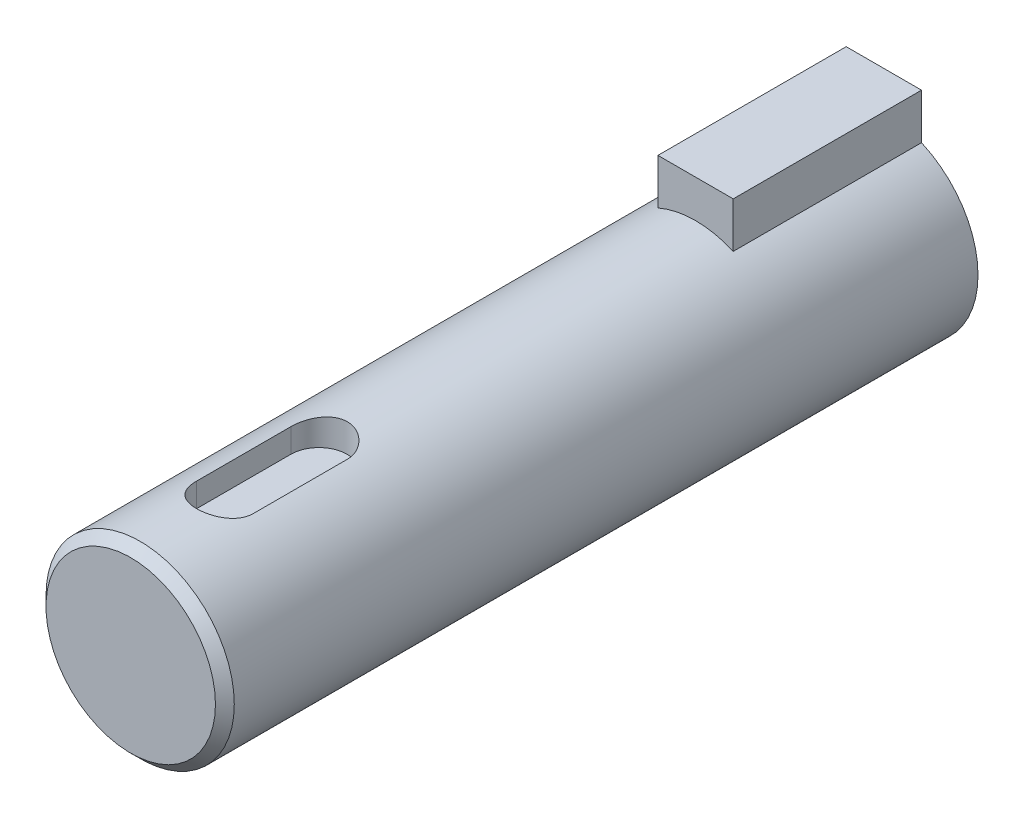
ISO-10303-21;
HEADER;
FILE_DESCRIPTION(('STEP AP214'),'2;1');
FILE_NAME('part.step','',(''),(''),'','','');
FILE_SCHEMA(('AUTOMOTIVE_DESIGN { 1 0 10303 214 1 1 1 1 }'));
ENDSEC;
DATA;
#1=APPLICATION_CONTEXT('core data for automotive mechanical design processes');
#2=APPLICATION_PROTOCOL_DEFINITION('international standard','automotive_design',2000,#1);
#3=PRODUCT_CONTEXT('',#1,'mechanical');
#4=PRODUCT('Part','Part','',(#3));
#5=PRODUCT_RELATED_PRODUCT_CATEGORY('part','',(#4));
#6=PRODUCT_DEFINITION_FORMATION('','',#4);
#7=PRODUCT_DEFINITION_CONTEXT('part definition',#1,'design');
#8=PRODUCT_DEFINITION('design','',#6,#7);
#9=PRODUCT_DEFINITION_SHAPE('','',#8);
#10=(LENGTH_UNIT() NAMED_UNIT(*) SI_UNIT(.MILLI.,.METRE.));
#11=(NAMED_UNIT(*) PLANE_ANGLE_UNIT() SI_UNIT($,.RADIAN.));
#12=(NAMED_UNIT(*) SI_UNIT($,.STERADIAN.) SOLID_ANGLE_UNIT());
#13=UNCERTAINTY_MEASURE_WITH_UNIT(LENGTH_MEASURE(1.E-05),#10,'distance_accuracy_value','');
#14=(GEOMETRIC_REPRESENTATION_CONTEXT(3) GLOBAL_UNCERTAINTY_ASSIGNED_CONTEXT((#13)) GLOBAL_UNIT_ASSIGNED_CONTEXT((#10,
#11,#12)) REPRESENTATION_CONTEXT('',''));
#15=CARTESIAN_POINT('',(0.,0.,0.));
#16=DIRECTION('',(0.,0.,1.));
#17=DIRECTION('',(1.,0.,0.));
#18=AXIS2_PLACEMENT_3D('',#15,#16,#17);
#19=CARTESIAN_POINT('',(0.,0.,10.));
#20=DIRECTION('',(0.,0.,-1.));
#21=DIRECTION('',(-1.,0.,0.));
#22=AXIS2_PLACEMENT_3D('',#19,#20,#21);
#23=CYLINDRICAL_SURFACE('',#22,5.);
#24=CARTESIAN_POINT('',(0.,0.,39.5));
#25=DIRECTION('',(0.,0.,1.));
#26=DIRECTION('',(1.,0.,0.));
#27=AXIS2_PLACEMENT_3D('',#24,#25,#26);
#28=CIRCLE('',#27,5.);
#29=CARTESIAN_POINT('',(5.,0.,39.5));
#30=VERTEX_POINT('',#29);
#31=EDGE_CURVE('E11',#30,#30,#28,.F.);
#32=ORIENTED_EDGE('',*,*,#31,.T.);
#33=EDGE_LOOP('',(#32));
#34=FACE_BOUND('',#33,.T.);
#35=CARTESIAN_POINT('',(0.,0.,0.));
#36=DIRECTION('',(0.,0.,1.));
#37=DIRECTION('',(1.,0.,0.));
#38=AXIS2_PLACEMENT_3D('',#35,#36,#37);
#39=CIRCLE('',#38,5.);
#40=CARTESIAN_POINT('',(-2.,4.58257569495584,0.));
#41=VERTEX_POINT('',#40);
#42=CARTESIAN_POINT('',(2.,4.58257569495584,0.));
#43=VERTEX_POINT('',#42);
#44=EDGE_CURVE('E173',#41,#43,#39,.T.);
#45=ORIENTED_EDGE('',*,*,#44,.T.);
#46=DIRECTION('',(0.,0.,-1.));
#47=VECTOR('',#46,1.);
#48=CARTESIAN_POINT('',(2.,4.58257569495584,10.));
#49=LINE('',#48,#47);
#50=CARTESIAN_POINT('',(2.,4.58257569495584,10.));
#51=VERTEX_POINT('',#50);
#52=EDGE_CURVE('E186',#51,#43,#49,.T.);
#53=ORIENTED_EDGE('',*,*,#52,.F.);
#54=CARTESIAN_POINT('',(0.,0.,10.));
#55=DIRECTION('',(0.,0.,1.));
#56=DIRECTION('',(1.,0.,0.));
#57=AXIS2_PLACEMENT_3D('',#54,#55,#56);
#58=CIRCLE('',#57,5.);
#59=CARTESIAN_POINT('',(-2.,4.58257569495584,10.));
#60=VERTEX_POINT('',#59);
#61=EDGE_CURVE('E128',#51,#60,#58,.T.);
#62=ORIENTED_EDGE('',*,*,#61,.T.);
#63=DIRECTION('',(0.,0.,-1.));
#64=VECTOR('',#63,1.);
#65=CARTESIAN_POINT('',(-2.,4.58257569495584,10.));
#66=LINE('',#65,#64);
#67=EDGE_CURVE('E190',#60,#41,#66,.T.);
#68=ORIENTED_EDGE('',*,*,#67,.T.);
#69=EDGE_LOOP('',(#45,#53,#62,#68));
#70=FACE_BOUND('',#69,.T.);
#71=CARTESIAN_POINT('',(1.5,4.76969600708473,30.));
#72=CARTESIAN_POINT('',(1.50000085357071,4.76969249084934,29.958820607092));
#73=CARTESIAN_POINT('',(1.49830317083428,4.77022997000129,29.9176619568739));
#74=CARTESIAN_POINT('',(1.49153785660317,4.77235095109999,29.8356588379044));
#75=CARTESIAN_POINT('',(1.48647098275841,4.77393421787376,29.7948143006051));
#76=CARTESIAN_POINT('',(1.46630203689311,4.78018490618873,29.6734094590453));
#77=CARTESIAN_POINT('',(1.44623120413662,4.78635370384275,29.5936936095836));
#78=CARTESIAN_POINT('',(1.39353102315626,4.80195952113208,29.4389644216141));
#79=CARTESIAN_POINT('',(1.36090607068203,4.81139539670393,29.3639494478019));
#80=CARTESIAN_POINT('',(1.28407841117655,4.83246571212052,29.2204033184024));
#81=CARTESIAN_POINT('',(1.23987031651226,4.84410117434933,29.1518752002716));
#82=CARTESIAN_POINT('',(1.13964850658326,4.86866835244721,29.021133944003));
#83=CARTESIAN_POINT('',(1.08333433465208,4.88162755412974,28.9591563396566));
#84=CARTESIAN_POINT('',(0.961138919873355,4.90714811559049,28.8453644161));
#85=CARTESIAN_POINT('',(0.895256063916348,4.91970940785249,28.793551813997));
#86=CARTESIAN_POINT('',(0.754109921315431,4.94333239727705,28.7005362296815));
#87=CARTESIAN_POINT('',(0.67868081933626,4.95435770971354,28.6595748197021));
#88=CARTESIAN_POINT('',(0.521621185505775,4.97334469846208,28.5910115883819));
#89=CARTESIAN_POINT('',(0.439992259012928,4.98130716463903,28.5634063222057));
#90=CARTESIAN_POINT('',(0.275324697874878,4.99307639935002,28.523120200898));
#91=CARTESIAN_POINT('',(0.192393125294254,4.99699549276993,28.5100351420303));
#92=CARTESIAN_POINT('',(0.0254235719980824,5.00063202022426,28.4978826586367));
#93=CARTESIAN_POINT('',(-0.0586141962423618,5.00035024971471,28.4988125802998));
#94=CARTESIAN_POINT('',(-0.222571599946016,4.99569602566267,28.514392908759));
#95=CARTESIAN_POINT('',(-0.302537145464641,4.99145415509187,28.5286053449787));
#96=CARTESIAN_POINT('',(-0.458890052102025,4.9795151369998,28.5696316352381));
#97=CARTESIAN_POINT('',(-0.535277225531998,4.97181780846028,28.5964461494559));
#98=CARTESIAN_POINT('',(-0.683347815892216,4.95365214926145,28.6622122216464));
#99=CARTESIAN_POINT('',(-0.754966006044142,4.94315255692525,28.7013016443569));
#100=CARTESIAN_POINT('',(-0.89076552957442,4.92049624651755,28.7903985900483));
#101=CARTESIAN_POINT('',(-0.954945191614595,4.90833915735884,28.8404085594788));
#102=CARTESIAN_POINT('',(-1.07665450541275,4.88311673571409,28.9521919880835));
#103=CARTESIAN_POINT('',(-1.13383351478034,4.87003445449554,29.0143438637608));
#104=CARTESIAN_POINT('',(-1.23706769492487,4.84484215114658,29.1474974234279));
#105=CARTESIAN_POINT('',(-1.28311962013078,4.83273241337565,29.2185016803655));
#106=CARTESIAN_POINT('',(-1.36316407240863,4.81077228795653,29.3682809284493));
#107=CARTESIAN_POINT('',(-1.39703006341134,4.80094596245948,29.4471271795934));
#108=CARTESIAN_POINT('',(-1.45085886004699,4.78495663653201,29.6097245039817));
#109=CARTESIAN_POINT('',(-1.47084293218035,4.77878803475875,29.6934678607144));
#110=CARTESIAN_POINT('',(-1.4890120359008,4.77314032325006,29.8149948890702));
#111=CARTESIAN_POINT('',(-1.49313202989009,4.77185156275267,29.8518907341796));
#112=CARTESIAN_POINT('',(-1.49862355614854,4.77012928611782,29.9258514790995));
#113=CARTESIAN_POINT('',(-1.49999912968269,4.76969451246644,29.9629160496639));
#114=CARTESIAN_POINT('',(-1.5,4.76969600708473,30.));
#115=B_SPLINE_CURVE_WITH_KNOTS('',3,(#71,#72,#73,#74,#75,#76,#77,#78,#79,#80,#81,#82,#83,#84,
#85,#86,#87,#88,#89,#90,#91,#92,#93,#94,#95,#96,#97,#98,#99,#100,#101,#102,#103,#104,#105,#106,
#107,#108,#109,#110,#111,#112,#113,#114),.UNSPECIFIED.,.F.,.F.,(4,2,2,2,2,2,2,2,2,2,2,2,2,2,2,2,
2,2,2,2,2,4),(0.,0.123459071219734,0.246890388853047,0.492911349615212,0.738846245884326,
0.984895736828095,1.23795510798803,1.49105719006936,1.74939356197455,2.00766326783256,
2.25854751319802,2.5093842528947,2.75223130012966,2.99509107067836,3.2407824256273,
3.48652887757005,3.74172568310981,3.99699683536777,4.25484698071527,4.51230123440207,
4.62365084745809,4.73483637253616),.UNSPECIFIED.);
#116=CARTESIAN_POINT('',(1.5,4.76969600708473,30.));
#117=VERTEX_POINT('',#116);
#118=CARTESIAN_POINT('',(-1.5,4.76969600708473,30.));
#119=VERTEX_POINT('',#118);
#120=EDGE_CURVE('E124',#117,#119,#115,.T.);
#121=ORIENTED_EDGE('',*,*,#120,.F.);
#122=DIRECTION('',(0.,0.,-1.));
#123=VECTOR('',#122,1.);
#124=CARTESIAN_POINT('',(1.5,4.76969600708473,10.));
#125=LINE('',#124,#123);
#126=CARTESIAN_POINT('',(1.5,4.76969600708473,35.));
#127=VERTEX_POINT('',#126);
#128=EDGE_CURVE('E194',#127,#117,#125,.T.);
#129=ORIENTED_EDGE('',*,*,#128,.F.);
#130=CARTESIAN_POINT('',(-1.5,4.76969600708473,35.));
#131=CARTESIAN_POINT('',(-1.50000085357071,4.76969249084934,35.041179392908));
#132=CARTESIAN_POINT('',(-1.49830317083428,4.77022997000129,35.0823380431261));
#133=CARTESIAN_POINT('',(-1.49153785660317,4.77235095109999,35.1643411620956));
#134=CARTESIAN_POINT('',(-1.48647098275841,4.77393421787376,35.2051856993949));
#135=CARTESIAN_POINT('',(-1.46630203689311,4.78018490618873,35.3265905409547));
#136=CARTESIAN_POINT('',(-1.44623120413662,4.78635370384275,35.4063063904164));
#137=CARTESIAN_POINT('',(-1.39353102315626,4.80195952113208,35.5610355783859));
#138=CARTESIAN_POINT('',(-1.36090607068203,4.81139539670393,35.6360505521981));
#139=CARTESIAN_POINT('',(-1.28407841117656,4.83246571212052,35.7795966815976));
#140=CARTESIAN_POINT('',(-1.23987031651226,4.84410117434933,35.8481247997284));
#141=CARTESIAN_POINT('',(-1.13964850658326,4.86866835244721,35.9788660559971));
#142=CARTESIAN_POINT('',(-1.08333433465208,4.88162755412974,36.0408436603434));
#143=CARTESIAN_POINT('',(-0.961138919873354,4.90714811559049,36.1546355839));
#144=CARTESIAN_POINT('',(-0.895256063916348,4.91970940785249,36.2064481860031));
#145=CARTESIAN_POINT('',(-0.754109921315429,4.94333239727705,36.2994637703185));
#146=CARTESIAN_POINT('',(-0.678680819336258,4.95435770971354,36.340425180298));
#147=CARTESIAN_POINT('',(-0.521621185505772,4.97334469846208,36.4089884116182));
#148=CARTESIAN_POINT('',(-0.439992259012925,4.98130716463903,36.4365936777943));
#149=CARTESIAN_POINT('',(-0.275324697874876,4.99307639935002,36.4768797991021));
#150=CARTESIAN_POINT('',(-0.192393125294252,4.99699549276993,36.4899648579698));
#151=CARTESIAN_POINT('',(-0.0254235719980805,5.00063202022426,36.5021173413633));
#152=CARTESIAN_POINT('',(0.0586141962423634,5.00035024971471,36.5011874197002));
#153=CARTESIAN_POINT('',(0.222571599946017,4.99569602566267,36.485607091241));
#154=CARTESIAN_POINT('',(0.302537145464641,4.99145415509187,36.4713946550213));
#155=CARTESIAN_POINT('',(0.458890052102025,4.9795151369998,36.4303683647619));
#156=CARTESIAN_POINT('',(0.535277225531998,4.97181780846028,36.4035538505441));
#157=CARTESIAN_POINT('',(0.683347815892216,4.95365214926145,36.3377877783536));
#158=CARTESIAN_POINT('',(0.754966006044142,4.94315255692525,36.2986983556431));
#159=CARTESIAN_POINT('',(0.89076552957442,4.92049624651755,36.2096014099517));
#160=CARTESIAN_POINT('',(0.954945191614595,4.90833915735884,36.1595914405212));
#161=CARTESIAN_POINT('',(1.07665450541275,4.88311673571409,36.0478080119165));
#162=CARTESIAN_POINT('',(1.13383351478034,4.87003445449554,35.9856561362393));
#163=CARTESIAN_POINT('',(1.23706769492487,4.84484215114658,35.8525025765721));
#164=CARTESIAN_POINT('',(1.28311962013078,4.83273241337565,35.7814983196345));
#165=CARTESIAN_POINT('',(1.36316407240863,4.81077228795653,35.6317190715507));
#166=CARTESIAN_POINT('',(1.39703006341135,4.80094596245948,35.5528728204066));
#167=CARTESIAN_POINT('',(1.45085886004699,4.78495663653201,35.3902754960183));
#168=CARTESIAN_POINT('',(1.47084293218036,4.77878803475875,35.3065321392856));
#169=CARTESIAN_POINT('',(1.4890120359008,4.77314032325006,35.1850051109298));
#170=CARTESIAN_POINT('',(1.49313202989009,4.77185156275267,35.1481092658204));
#171=CARTESIAN_POINT('',(1.49862355614854,4.77012928611782,35.0741485209005));
#172=CARTESIAN_POINT('',(1.49999912968269,4.76969451246644,35.0370839503361));
#173=CARTESIAN_POINT('',(1.5,4.76969600708473,35.));
#174=B_SPLINE_CURVE_WITH_KNOTS('',3,(#130,#131,#132,#133,#134,#135,#136,#137,#138,#139,#140,
#141,#142,#143,#144,#145,#146,#147,#148,#149,#150,#151,#152,#153,#154,#155,#156,#157,#158,#159,
#160,#161,#162,#163,#164,#165,#166,#167,#168,#169,#170,#171,#172,#173),.UNSPECIFIED.,.F.,.F.,(4,
2,2,2,2,2,2,2,2,2,2,2,2,2,2,2,2,2,2,2,2,4),(0.,0.123459071219744,0.246890388853047,
0.492911349615212,0.738846245884322,0.984895736828089,1.23795510798803,1.49105719006936,
1.74939356197455,2.00766326783256,2.25854751319802,2.5093842528947,2.75223130012966,
2.99509107067836,3.2407824256273,3.48652887757005,3.74172568310981,3.99699683536778,
4.25484698071527,4.51230123440207,4.62365084745809,4.73483637253616),.UNSPECIFIED.);
#175=CARTESIAN_POINT('',(-1.5,4.76969600708473,35.));
#176=VERTEX_POINT('',#175);
#177=EDGE_CURVE('E197',#176,#127,#174,.T.);
#178=ORIENTED_EDGE('',*,*,#177,.F.);
#179=DIRECTION('',(0.,0.,-1.));
#180=VECTOR('',#179,1.);
#181=CARTESIAN_POINT('',(-1.5,4.76969600708473,10.));
#182=LINE('',#181,#180);
#183=EDGE_CURVE('E206',#119,#176,#182,.F.);
#184=ORIENTED_EDGE('',*,*,#183,.F.);
#185=EDGE_LOOP('',(#121,#129,#178,#184));
#186=FACE_BOUND('',#185,.T.);
#187=ADVANCED_FACE('F41',(#34,#70,#186),#23,.T.);
#188=CARTESIAN_POINT('',(-2.,7.,10.));
#189=DIRECTION('',(1.,0.,0.));
#190=DIRECTION('',(0.,1.,0.));
#191=AXIS2_PLACEMENT_3D('',#188,#189,#190);
#192=PLANE('',#191);
#193=DIRECTION('',(0.,-1.,0.));
#194=VECTOR('',#193,1.);
#195=CARTESIAN_POINT('',(-2.,7.,0.));
#196=LINE('',#195,#194);
#197=CARTESIAN_POINT('',(-2.,7.,0.));
#198=VERTEX_POINT('',#197);
#199=EDGE_CURVE('E161',#198,#41,#196,.T.);
#200=ORIENTED_EDGE('',*,*,#199,.T.);
#201=ORIENTED_EDGE('',*,*,#67,.F.);
#202=DIRECTION('',(0.,-1.,0.));
#203=VECTOR('',#202,1.);
#204=CARTESIAN_POINT('',(-2.,7.,10.));
#205=LINE('',#204,#203);
#206=CARTESIAN_POINT('',(-2.,7.,10.));
#207=VERTEX_POINT('',#206);
#208=EDGE_CURVE('E91',#207,#60,#205,.T.);
#209=ORIENTED_EDGE('',*,*,#208,.F.);
#210=DIRECTION('',(0.,0.,-1.));
#211=VECTOR('',#210,1.);
#212=CARTESIAN_POINT('',(-2.,7.,10.));
#213=LINE('',#212,#211);
#214=EDGE_CURVE('E169',#207,#198,#213,.T.);
#215=ORIENTED_EDGE('',*,*,#214,.T.);
#216=EDGE_LOOP('',(#200,#201,#209,#215));
#217=FACE_BOUND('',#216,.T.);
#218=ADVANCED_FACE('F242',(#217),#192,.F.);
#219=CARTESIAN_POINT('',(2.,7.,10.));
#220=DIRECTION('',(-1.,0.,0.));
#221=DIRECTION('',(0.,-1.,0.));
#222=AXIS2_PLACEMENT_3D('',#219,#220,#221);
#223=PLANE('',#222);
#224=DIRECTION('',(0.,1.,0.));
#225=VECTOR('',#224,1.);
#226=CARTESIAN_POINT('',(2.,7.,0.));
#227=LINE('',#226,#225);
#228=CARTESIAN_POINT('',(2.,7.,0.));
#229=VERTEX_POINT('',#228);
#230=EDGE_CURVE('E176',#43,#229,#227,.T.);
#231=ORIENTED_EDGE('',*,*,#230,.T.);
#232=DIRECTION('',(0.,0.,-1.));
#233=VECTOR('',#232,1.);
#234=CARTESIAN_POINT('',(2.,7.,10.));
#235=LINE('',#234,#233);
#236=CARTESIAN_POINT('',(2.,7.,10.));
#237=VERTEX_POINT('',#236);
#238=EDGE_CURVE('E183',#237,#229,#235,.T.);
#239=ORIENTED_EDGE('',*,*,#238,.F.);
#240=DIRECTION('',(0.,1.,0.));
#241=VECTOR('',#240,1.);
#242=CARTESIAN_POINT('',(2.,7.,10.));
#243=LINE('',#242,#241);
#244=EDGE_CURVE('E164',#51,#237,#243,.T.);
#245=ORIENTED_EDGE('',*,*,#244,.F.);
#246=ORIENTED_EDGE('',*,*,#52,.T.);
#247=EDGE_LOOP('',(#231,#239,#245,#246));
#248=FACE_BOUND('',#247,.T.);
#249=ADVANCED_FACE('F247',(#248),#223,.F.);
#250=CARTESIAN_POINT('',(-2.,7.,10.));
#251=DIRECTION('',(0.,-1.,0.));
#252=DIRECTION('',(0.,0.,-1.));
#253=AXIS2_PLACEMENT_3D('',#250,#251,#252);
#254=PLANE('',#253);
#255=DIRECTION('',(-1.,0.,0.));
#256=VECTOR('',#255,1.);
#257=CARTESIAN_POINT('',(-2.,7.,0.));
#258=LINE('',#257,#256);
#259=EDGE_CURVE('E87',#229,#198,#258,.T.);
#260=ORIENTED_EDGE('',*,*,#259,.T.);
#261=ORIENTED_EDGE('',*,*,#214,.F.);
#262=DIRECTION('',(-1.,0.,0.));
#263=VECTOR('',#262,1.);
#264=CARTESIAN_POINT('',(-2.,7.,10.));
#265=LINE('',#264,#263);
#266=EDGE_CURVE('E67',#237,#207,#265,.T.);
#267=ORIENTED_EDGE('',*,*,#266,.F.);
#268=ORIENTED_EDGE('',*,*,#238,.T.);
#269=EDGE_LOOP('',(#260,#261,#267,#268));
#270=FACE_BOUND('',#269,.T.);
#271=ADVANCED_FACE('F313',(#270),#254,.F.);
#272=CARTESIAN_POINT('',(0.,0.,10.));
#273=DIRECTION('',(0.,0.,1.));
#274=DIRECTION('',(1.,0.,0.));
#275=AXIS2_PLACEMENT_3D('',#272,#273,#274);
#276=PLANE('',#275);
#277=ORIENTED_EDGE('',*,*,#61,.F.);
#278=ORIENTED_EDGE('',*,*,#244,.T.);
#279=ORIENTED_EDGE('',*,*,#266,.T.);
#280=ORIENTED_EDGE('',*,*,#208,.T.);
#281=EDGE_LOOP('',(#277,#278,#279,#280));
#282=FACE_BOUND('',#281,.T.);
#283=ADVANCED_FACE('F309',(#282),#276,.T.);
#284=CARTESIAN_POINT('',(0.,0.,0.));
#285=DIRECTION('',(0.,0.,1.));
#286=DIRECTION('',(1.,0.,0.));
#287=AXIS2_PLACEMENT_3D('',#284,#285,#286);
#288=PLANE('',#287);
#289=ORIENTED_EDGE('',*,*,#199,.F.);
#290=ORIENTED_EDGE('',*,*,#259,.F.);
#291=ORIENTED_EDGE('',*,*,#230,.F.);
#292=ORIENTED_EDGE('',*,*,#44,.F.);
#293=EDGE_LOOP('',(#289,#290,#291,#292));
#294=FACE_BOUND('',#293,.T.);
#295=ADVANCED_FACE('F279',(#294),#288,.F.);
#296=CARTESIAN_POINT('',(0.,0.,40.));
#297=DIRECTION('',(0.,0.,1.));
#298=DIRECTION('',(1.,0.,0.));
#299=AXIS2_PLACEMENT_3D('',#296,#297,#298);
#300=PLANE('',#299);
#301=CARTESIAN_POINT('',(0.,0.,40.));
#302=DIRECTION('',(0.,0.,1.));
#303=DIRECTION('',(1.,0.,0.));
#304=AXIS2_PLACEMENT_3D('',#301,#302,#303);
#305=CIRCLE('',#304,4.5);
#306=CARTESIAN_POINT('',(4.5,0.,40.));
#307=VERTEX_POINT('',#306);
#308=EDGE_CURVE('E51',#307,#307,#305,.T.);
#309=ORIENTED_EDGE('',*,*,#308,.T.);
#310=EDGE_LOOP('',(#309));
#311=FACE_BOUND('',#310,.T.);
#312=ADVANCED_FACE('F223',(#311),#300,.T.);
#313=CARTESIAN_POINT('',(0.,7.,30.));
#314=DIRECTION('',(0.,-1.,0.));
#315=DIRECTION('',(0.,0.,-1.));
#316=AXIS2_PLACEMENT_3D('',#313,#314,#315);
#317=CYLINDRICAL_SURFACE('',#316,1.5);
#318=ORIENTED_EDGE('',*,*,#120,.T.);
#319=DIRECTION('',(0.,-1.,0.));
#320=VECTOR('',#319,1.);
#321=CARTESIAN_POINT('',(-1.5,7.,30.));
#322=LINE('',#321,#320);
#323=CARTESIAN_POINT('',(-1.5,3.5,30.));
#324=VERTEX_POINT('',#323);
#325=EDGE_CURVE('E117',#119,#324,#322,.T.);
#326=ORIENTED_EDGE('',*,*,#325,.T.);
#327=CARTESIAN_POINT('',(0.,3.5,30.));
#328=DIRECTION('',(0.,1.,0.));
#329=DIRECTION('',(0.,0.,1.));
#330=AXIS2_PLACEMENT_3D('',#327,#328,#329);
#331=CIRCLE('',#330,1.5);
#332=CARTESIAN_POINT('',(1.5,3.5,30.));
#333=VERTEX_POINT('',#332);
#334=EDGE_CURVE('E122',#333,#324,#331,.T.);
#335=ORIENTED_EDGE('',*,*,#334,.F.);
#336=DIRECTION('',(0.,-1.,0.));
#337=VECTOR('',#336,1.);
#338=CARTESIAN_POINT('',(1.5,7.,30.));
#339=LINE('',#338,#337);
#340=EDGE_CURVE('E151',#117,#333,#339,.T.);
#341=ORIENTED_EDGE('',*,*,#340,.F.);
#342=EDGE_LOOP('',(#318,#326,#335,#341));
#343=FACE_BOUND('',#342,.T.);
#344=ADVANCED_FACE('F119',(#343),#317,.F.);
#345=CARTESIAN_POINT('',(-1.5,7.,30.));
#346=DIRECTION('',(1.,0.,0.));
#347=DIRECTION('',(0.,0.,-1.));
#348=AXIS2_PLACEMENT_3D('',#345,#346,#347);
#349=PLANE('',#348);
#350=ORIENTED_EDGE('',*,*,#183,.T.);
#351=DIRECTION('',(0.,-1.,0.));
#352=VECTOR('',#351,1.);
#353=CARTESIAN_POINT('',(-1.5,7.,35.));
#354=LINE('',#353,#352);
#355=CARTESIAN_POINT('',(-1.5,3.5,35.));
#356=VERTEX_POINT('',#355);
#357=EDGE_CURVE('E129',#176,#356,#354,.T.);
#358=ORIENTED_EDGE('',*,*,#357,.T.);
#359=DIRECTION('',(0.,0.,1.));
#360=VECTOR('',#359,1.);
#361=CARTESIAN_POINT('',(-1.5,3.5,30.));
#362=LINE('',#361,#360);
#363=EDGE_CURVE('E132',#324,#356,#362,.T.);
#364=ORIENTED_EDGE('',*,*,#363,.F.);
#365=ORIENTED_EDGE('',*,*,#325,.F.);
#366=EDGE_LOOP('',(#350,#358,#364,#365));
#367=FACE_BOUND('',#366,.T.);
#368=ADVANCED_FACE('F133',(#367),#349,.T.);
#369=CARTESIAN_POINT('',(0.,7.,35.));
#370=DIRECTION('',(0.,-1.,0.));
#371=DIRECTION('',(0.,0.,-1.));
#372=AXIS2_PLACEMENT_3D('',#369,#370,#371);
#373=CYLINDRICAL_SURFACE('',#372,1.5);
#374=ORIENTED_EDGE('',*,*,#177,.T.);
#375=DIRECTION('',(0.,-1.,0.));
#376=VECTOR('',#375,1.);
#377=CARTESIAN_POINT('',(1.5,7.,35.));
#378=LINE('',#377,#376);
#379=CARTESIAN_POINT('',(1.5,3.5,35.));
#380=VERTEX_POINT('',#379);
#381=EDGE_CURVE('E58',#127,#380,#378,.T.);
#382=ORIENTED_EDGE('',*,*,#381,.T.);
#383=CARTESIAN_POINT('',(0.,3.5,35.));
#384=DIRECTION('',(0.,1.,0.));
#385=DIRECTION('',(0.,0.,1.));
#386=AXIS2_PLACEMENT_3D('',#383,#384,#385);
#387=CIRCLE('',#386,1.5);
#388=EDGE_CURVE('E139',#356,#380,#387,.T.);
#389=ORIENTED_EDGE('',*,*,#388,.F.);
#390=ORIENTED_EDGE('',*,*,#357,.F.);
#391=EDGE_LOOP('',(#374,#382,#389,#390));
#392=FACE_BOUND('',#391,.T.);
#393=ADVANCED_FACE('F210',(#392),#373,.F.);
#394=CARTESIAN_POINT('',(1.5,7.,30.));
#395=DIRECTION('',(-1.,0.,0.));
#396=DIRECTION('',(0.,0.,1.));
#397=AXIS2_PLACEMENT_3D('',#394,#395,#396);
#398=PLANE('',#397);
#399=ORIENTED_EDGE('',*,*,#128,.T.);
#400=ORIENTED_EDGE('',*,*,#340,.T.);
#401=DIRECTION('',(0.,0.,-1.));
#402=VECTOR('',#401,1.);
#403=CARTESIAN_POINT('',(1.5,3.5,30.));
#404=LINE('',#403,#402);
#405=EDGE_CURVE('E143',#380,#333,#404,.T.);
#406=ORIENTED_EDGE('',*,*,#405,.F.);
#407=ORIENTED_EDGE('',*,*,#381,.F.);
#408=EDGE_LOOP('',(#399,#400,#406,#407));
#409=FACE_BOUND('',#408,.T.);
#410=ADVANCED_FACE('F215',(#409),#398,.T.);
#411=CARTESIAN_POINT('',(0.,3.5,30.));
#412=DIRECTION('',(0.,1.,0.));
#413=DIRECTION('',(0.,0.,1.));
#414=AXIS2_PLACEMENT_3D('',#411,#412,#413);
#415=PLANE('',#414);
#416=ORIENTED_EDGE('',*,*,#334,.T.);
#417=ORIENTED_EDGE('',*,*,#363,.T.);
#418=ORIENTED_EDGE('',*,*,#388,.T.);
#419=ORIENTED_EDGE('',*,*,#405,.T.);
#420=EDGE_LOOP('',(#416,#417,#418,#419));
#421=FACE_BOUND('',#420,.T.);
#422=ADVANCED_FACE('F142',(#421),#415,.T.);
#423=CARTESIAN_POINT('',(0.,0.,40.));
#424=DIRECTION('',(0.,0.,-1.));
#425=DIRECTION('',(-1.,0.,0.));
#426=AXIS2_PLACEMENT_3D('',#423,#424,#425);
#427=CONICAL_SURFACE('',#426,4.5,0.78539816339745);
#428=ORIENTED_EDGE('',*,*,#31,.F.);
#429=EDGE_LOOP('',(#428));
#430=FACE_BOUND('',#429,.T.);
#431=ORIENTED_EDGE('',*,*,#308,.F.);
#432=EDGE_LOOP('',(#431));
#433=FACE_BOUND('',#432,.T.);
#434=ADVANCED_FACE('F44',(#430,#433),#427,.T.);
#435=CLOSED_SHELL('',(#187,#218,#249,#271,#283,#295,#312,#344,#368,#393,#410,#422,#434));
#436=MANIFOLD_SOLID_BREP('B2',#435);
#437=ADVANCED_BREP_SHAPE_REPRESENTATION('',(#18,#436),#14);
#438=SHAPE_DEFINITION_REPRESENTATION(#9,#437);
ENDSEC;
END-ISO-10303-21;
